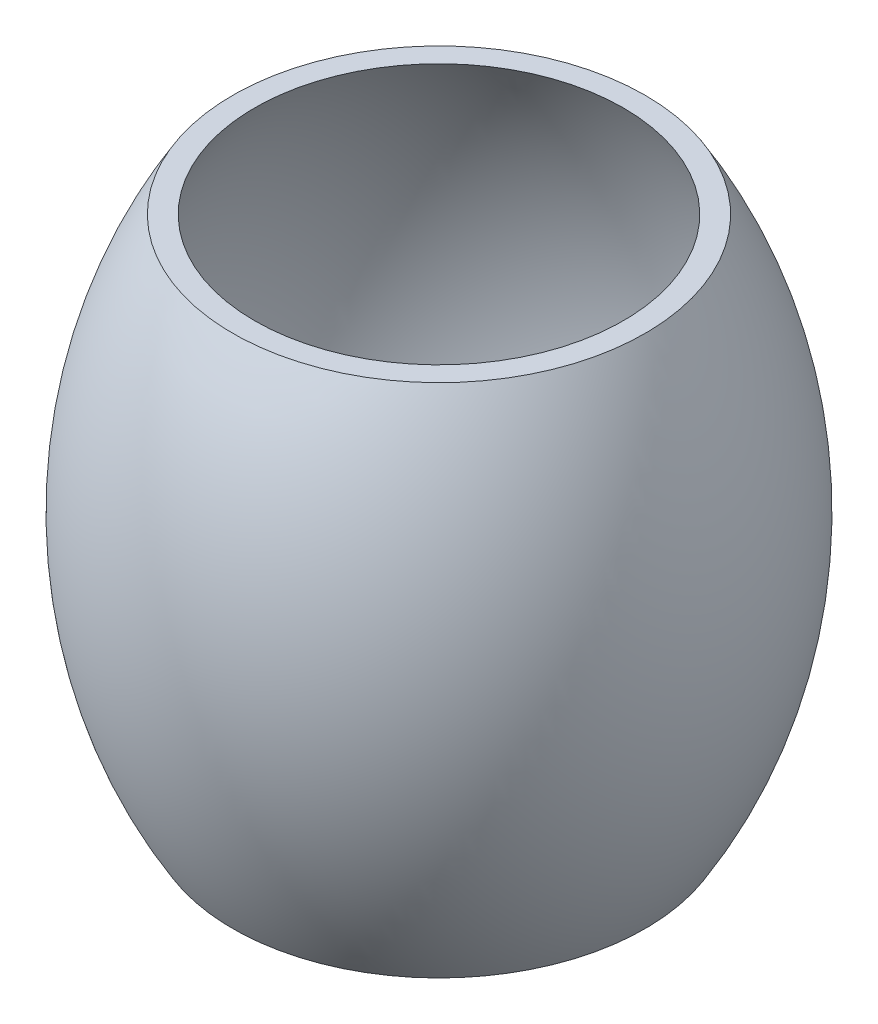
ISO-10303-21;
HEADER;
FILE_DESCRIPTION(('STEP AP214'),'2;1');
FILE_NAME('part.step','',(''),(''),'','','');
FILE_SCHEMA(('AUTOMOTIVE_DESIGN { 1 0 10303 214 1 1 1 1 }'));
ENDSEC;
DATA;
#1=APPLICATION_CONTEXT('core data for automotive mechanical design processes');
#2=APPLICATION_PROTOCOL_DEFINITION('international standard','automotive_design',2000,#1);
#3=PRODUCT_CONTEXT('',#1,'mechanical');
#4=PRODUCT('Part','Part','',(#3));
#5=PRODUCT_RELATED_PRODUCT_CATEGORY('part','',(#4));
#6=PRODUCT_DEFINITION_FORMATION('','',#4);
#7=PRODUCT_DEFINITION_CONTEXT('part definition',#1,'design');
#8=PRODUCT_DEFINITION('design','',#6,#7);
#9=PRODUCT_DEFINITION_SHAPE('','',#8);
#10=(LENGTH_UNIT() NAMED_UNIT(*) SI_UNIT(.MILLI.,.METRE.));
#11=(NAMED_UNIT(*) PLANE_ANGLE_UNIT() SI_UNIT($,.RADIAN.));
#12=(NAMED_UNIT(*) SI_UNIT($,.STERADIAN.) SOLID_ANGLE_UNIT());
#13=UNCERTAINTY_MEASURE_WITH_UNIT(LENGTH_MEASURE(1.E-05),#10,'distance_accuracy_value','');
#14=(GEOMETRIC_REPRESENTATION_CONTEXT(3) GLOBAL_UNCERTAINTY_ASSIGNED_CONTEXT((#13)) GLOBAL_UNIT_ASSIGNED_CONTEXT((#10,
#11,#12)) REPRESENTATION_CONTEXT('',''));
#15=CARTESIAN_POINT('',(0.,0.,0.));
#16=DIRECTION('',(0.,0.,1.));
#17=DIRECTION('',(1.,0.,0.));
#18=AXIS2_PLACEMENT_3D('',#15,#16,#17);
#19=CARTESIAN_POINT('',(0.,-51.7505235046713,0.));
#20=DIRECTION('',(0.,1.,0.));
#21=DIRECTION('',(0.,0.,1.));
#22=AXIS2_PLACEMENT_3D('',#19,#20,#21);
#23=PLANE('',#22);
#24=CARTESIAN_POINT('',(128.087550226234,-51.7505235046713,-73.9513816029573));
#25=DIRECTION('',(0.,1.,0.));
#26=DIRECTION('',(0.,0.,1.));
#27=AXIS2_PLACEMENT_3D('',#24,#25,#26);
#28=CIRCLE('',#27,22.4999999999971);
#29=CARTESIAN_POINT('',(128.087550226234,-51.7505235046713,-51.4513816029602));
#30=VERTEX_POINT('',#29);
#31=EDGE_CURVE('E60',#30,#30,#28,.F.);
#32=ORIENTED_EDGE('',*,*,#31,.F.);
#33=EDGE_LOOP('',(#32));
#34=FACE_BOUND('',#33,.T.);
#35=CARTESIAN_POINT('',(0.,-51.7505235046713,0.));
#36=DIRECTION('',(0.,-1.,0.));
#37=DIRECTION('',(0.,0.,-1.));
#38=AXIS2_PLACEMENT_3D('',#35,#36,#37);
#39=CIRCLE('',#38,200.);
#40=CARTESIAN_POINT('',(0.,-51.7505235046713,-200.));
#41=VERTEX_POINT('',#40);
#42=EDGE_CURVE('E66',#41,#41,#39,.T.);
#43=ORIENTED_EDGE('',*,*,#42,.T.);
#44=EDGE_LOOP('',(#43));
#45=FACE_BOUND('',#44,.T.);
#46=CARTESIAN_POINT('',(7.74964473582105E-12,-51.7505235046713,147.902763205909));
#47=DIRECTION('',(0.,1.,0.));
#48=DIRECTION('',(0.,0.,1.));
#49=AXIS2_PLACEMENT_3D('',#46,#47,#48);
#50=CIRCLE('',#49,22.4999999999915);
#51=CARTESIAN_POINT('',(7.74964473582105E-12,-51.7505235046713,170.4027632059));
#52=VERTEX_POINT('',#51);
#53=EDGE_CURVE('E63',#52,#52,#50,.F.);
#54=ORIENTED_EDGE('',*,*,#53,.F.);
#55=EDGE_LOOP('',(#54));
#56=FACE_BOUND('',#55,.T.);
#57=CARTESIAN_POINT('',(-128.087550226229,-51.7505235046713,-73.9513816029513));
#58=DIRECTION('',(0.,1.,0.));
#59=DIRECTION('',(0.,0.,1.));
#60=AXIS2_PLACEMENT_3D('',#57,#58,#59);
#61=CIRCLE('',#60,22.5);
#62=CARTESIAN_POINT('',(-128.087550226229,-51.7505235046713,-51.4513816029513));
#63=VERTEX_POINT('',#62);
#64=EDGE_CURVE('E57',#63,#63,#61,.F.);
#65=ORIENTED_EDGE('',*,*,#64,.F.);
#66=EDGE_LOOP('',(#65));
#67=FACE_BOUND('',#66,.T.);
#68=ADVANCED_FACE('F31',(#34,#45,#56,#67),#23,.F.);
#69=CARTESIAN_POINT('',(0.,448.249476495329,0.));
#70=DIRECTION('',(0.,1.,0.));
#71=DIRECTION('',(0.,0.,1.));
#72=AXIS2_PLACEMENT_3D('',#69,#70,#71);
#73=CONICAL_SURFACE('',#72,0.,1.57079538252152);
#74=CARTESIAN_POINT('',(0.,448.249645364481,0.));
#75=DIRECTION('',(0.,-1.,0.));
#76=DIRECTION('',(0.,0.,-1.));
#77=AXIS2_PLACEMENT_3D('',#74,#75,#76);
#78=CIRCLE('',#77,178.835025618102);
#79=CARTESIAN_POINT('',(0.,448.249645364481,-178.835025618102));
#80=VERTEX_POINT('',#79);
#81=EDGE_CURVE('E73',#80,#80,#78,.T.);
#82=ORIENTED_EDGE('',*,*,#81,.T.);
#83=EDGE_LOOP('',(#82));
#84=FACE_BOUND('',#83,.T.);
#85=CARTESIAN_POINT('',(0.,448.249665350003,0.));
#86=DIRECTION('',(0.,-1.,0.));
#87=DIRECTION('',(0.,0.,-1.));
#88=AXIS2_PLACEMENT_3D('',#85,#86,#87);
#89=CIRCLE('',#88,199.999999999911);
#90=CARTESIAN_POINT('',(0.,448.249665350003,-199.999999999911));
#91=VERTEX_POINT('',#90);
#92=EDGE_CURVE('E69',#91,#91,#89,.T.);
#93=ORIENTED_EDGE('',*,*,#92,.F.);
#94=EDGE_LOOP('',(#93));
#95=FACE_BOUND('',#94,.T.);
#96=ADVANCED_FACE('F92',(#84,#95),#73,.F.);
#97=CARTESIAN_POINT('',(0.,198.249570922592,0.));
#98=DIRECTION('',(0.,-1.,0.));
#99=DIRECTION('',(0.,0.,-1.));
#100=AXIS2_PLACEMENT_3D('',#97,#98,#99);
#101=DEGENERATE_TOROIDAL_SURFACE('',#100,214.865376896361,484.369,.F.);
#102=ORIENTED_EDGE('',*,*,#42,.F.);
#103=EDGE_LOOP('',(#102));
#104=FACE_BOUND('',#103,.T.);
#105=ORIENTED_EDGE('',*,*,#92,.T.);
#106=EDGE_LOOP('',(#105));
#107=FACE_BOUND('',#106,.T.);
#108=ADVANCED_FACE('F84',(#104,#107),#101,.F.);
#109=CARTESIAN_POINT('',(0.,-33.7505235046713,0.));
#110=DIRECTION('',(0.,1.,0.));
#111=DIRECTION('',(0.,0.,1.));
#112=AXIS2_PLACEMENT_3D('',#109,#110,#111);
#113=PLANE('',#112);
#114=CARTESIAN_POINT('',(0.,-33.7505235046713,0.));
#115=DIRECTION('',(0.,1.,0.));
#116=DIRECTION('',(0.,0.,1.));
#117=AXIS2_PLACEMENT_3D('',#114,#115,#116);
#118=CIRCLE('',#117,189.703529900418);
#119=CARTESIAN_POINT('',(0.,-33.7505235046713,189.703529900418));
#120=VERTEX_POINT('',#119);
#121=EDGE_CURVE('E72',#120,#120,#118,.F.);
#122=ORIENTED_EDGE('',*,*,#121,.F.);
#123=EDGE_LOOP('',(#122));
#124=FACE_BOUND('',#123,.T.);
#125=ADVANCED_FACE('F82',(#124),#113,.T.);
#126=CARTESIAN_POINT('',(0.,198.249570922592,0.));
#127=DIRECTION('',(0.,-1.,0.));
#128=DIRECTION('',(0.,0.,-1.));
#129=AXIS2_PLACEMENT_3D('',#126,#127,#128);
#130=DEGENERATE_TOROIDAL_SURFACE('',#129,214.865376896361,466.369,.F.);
#131=ORIENTED_EDGE('',*,*,#121,.T.);
#132=EDGE_LOOP('',(#131));
#133=FACE_BOUND('',#132,.T.);
#134=ORIENTED_EDGE('',*,*,#81,.F.);
#135=EDGE_LOOP('',(#134));
#136=FACE_BOUND('',#135,.T.);
#137=ADVANCED_FACE('F79',(#133,#136),#130,.T.);
#138=CARTESIAN_POINT('',(7.74964473582105E-12,-71.7505235046713,147.902763205909));
#139=DIRECTION('',(0.,1.,0.));
#140=DIRECTION('',(0.,0.,1.));
#141=AXIS2_PLACEMENT_3D('',#138,#139,#140);
#142=CYLINDRICAL_SURFACE('',#141,22.4999999999915);
#143=CARTESIAN_POINT('',(7.74964473582105E-12,-66.7505235046713,147.902763205909));
#144=DIRECTION('',(0.,-1.,0.));
#145=DIRECTION('',(0.,0.,-1.));
#146=AXIS2_PLACEMENT_3D('',#143,#144,#145);
#147=CIRCLE('',#146,22.4999999999915);
#148=CARTESIAN_POINT('',(7.74964473582105E-12,-66.7505235046713,125.402763205917));
#149=VERTEX_POINT('',#148);
#150=EDGE_CURVE('E10',#149,#149,#147,.F.);
#151=ORIENTED_EDGE('',*,*,#150,.T.);
#152=EDGE_LOOP('',(#151));
#153=FACE_BOUND('',#152,.T.);
#154=ORIENTED_EDGE('',*,*,#53,.T.);
#155=EDGE_LOOP('',(#154));
#156=FACE_BOUND('',#155,.T.);
#157=ADVANCED_FACE('F90',(#153,#156),#142,.T.);
#158=CARTESIAN_POINT('',(7.74964473582105E-12,-71.7505235046713,147.902763205909));
#159=DIRECTION('',(0.,-1.,0.));
#160=DIRECTION('',(0.,0.,-1.));
#161=AXIS2_PLACEMENT_3D('',#158,#159,#160);
#162=PLANE('',#161);
#163=CARTESIAN_POINT('',(7.74964473582105E-12,-71.7505235046713,147.902763205909));
#164=DIRECTION('',(0.,-1.,0.));
#165=DIRECTION('',(0.,0.,-1.));
#166=AXIS2_PLACEMENT_3D('',#163,#164,#165);
#167=CIRCLE('',#166,17.4999999999915);
#168=CARTESIAN_POINT('',(7.74964473582105E-12,-71.7505235046713,130.402763205917));
#169=VERTEX_POINT('',#168);
#170=EDGE_CURVE('E38',#169,#169,#167,.T.);
#171=ORIENTED_EDGE('',*,*,#170,.T.);
#172=EDGE_LOOP('',(#171));
#173=FACE_BOUND('',#172,.T.);
#174=ADVANCED_FACE('F138',(#173),#162,.T.);
#175=CARTESIAN_POINT('',(128.087550226234,-71.7505235046713,-73.9513816029573));
#176=DIRECTION('',(0.,1.,0.));
#177=DIRECTION('',(0.,0.,1.));
#178=AXIS2_PLACEMENT_3D('',#175,#176,#177);
#179=CYLINDRICAL_SURFACE('',#178,22.4999999999971);
#180=CARTESIAN_POINT('',(128.087550226234,-66.7505235046713,-73.9513816029573));
#181=DIRECTION('',(0.,-1.,0.));
#182=DIRECTION('',(0.,0.,-1.));
#183=AXIS2_PLACEMENT_3D('',#180,#181,#182);
#184=CIRCLE('',#183,22.4999999999971);
#185=CARTESIAN_POINT('',(128.087550226234,-66.7505235046713,-96.4513816029545));
#186=VERTEX_POINT('',#185);
#187=EDGE_CURVE('E51',#186,#186,#184,.F.);
#188=ORIENTED_EDGE('',*,*,#187,.T.);
#189=EDGE_LOOP('',(#188));
#190=FACE_BOUND('',#189,.T.);
#191=ORIENTED_EDGE('',*,*,#31,.T.);
#192=EDGE_LOOP('',(#191));
#193=FACE_BOUND('',#192,.T.);
#194=ADVANCED_FACE('F134',(#190,#193),#179,.T.);
#195=CARTESIAN_POINT('',(128.087550226234,-71.7505235046713,-73.9513816029573));
#196=DIRECTION('',(0.,-1.,0.));
#197=DIRECTION('',(0.,0.,-1.));
#198=AXIS2_PLACEMENT_3D('',#195,#196,#197);
#199=PLANE('',#198);
#200=CARTESIAN_POINT('',(128.087550226234,-71.7505235046713,-73.9513816029573));
#201=DIRECTION('',(0.,-1.,0.));
#202=DIRECTION('',(0.,0.,-1.));
#203=AXIS2_PLACEMENT_3D('',#200,#201,#202);
#204=CIRCLE('',#203,17.4999999999971);
#205=CARTESIAN_POINT('',(128.087550226234,-71.7505235046713,-91.4513816029545));
#206=VERTEX_POINT('',#205);
#207=EDGE_CURVE('E54',#206,#206,#204,.T.);
#208=ORIENTED_EDGE('',*,*,#207,.T.);
#209=EDGE_LOOP('',(#208));
#210=FACE_BOUND('',#209,.T.);
#211=ADVANCED_FACE('F128',(#210),#199,.T.);
#212=CARTESIAN_POINT('',(-128.087550226229,-71.7505235046713,-73.9513816029513));
#213=DIRECTION('',(0.,1.,0.));
#214=DIRECTION('',(0.,0.,1.));
#215=AXIS2_PLACEMENT_3D('',#212,#213,#214);
#216=CYLINDRICAL_SURFACE('',#215,22.5);
#217=CARTESIAN_POINT('',(-128.087550226229,-66.7505235046713,-73.9513816029513));
#218=DIRECTION('',(0.,-1.,0.));
#219=DIRECTION('',(0.,0.,-1.));
#220=AXIS2_PLACEMENT_3D('',#217,#218,#219);
#221=CIRCLE('',#220,22.5);
#222=CARTESIAN_POINT('',(-128.087550226229,-66.7505235046713,-96.4513816029512));
#223=VERTEX_POINT('',#222);
#224=EDGE_CURVE('E42',#223,#223,#221,.F.);
#225=ORIENTED_EDGE('',*,*,#224,.T.);
#226=EDGE_LOOP('',(#225));
#227=FACE_BOUND('',#226,.T.);
#228=ORIENTED_EDGE('',*,*,#64,.T.);
#229=EDGE_LOOP('',(#228));
#230=FACE_BOUND('',#229,.T.);
#231=ADVANCED_FACE('F123',(#227,#230),#216,.T.);
#232=CARTESIAN_POINT('',(-128.087550226229,-71.7505235046713,-73.9513816029513));
#233=DIRECTION('',(0.,-1.,0.));
#234=DIRECTION('',(0.,0.,-1.));
#235=AXIS2_PLACEMENT_3D('',#232,#233,#234);
#236=PLANE('',#235);
#237=CARTESIAN_POINT('',(-128.087550226229,-71.7505235046713,-73.9513816029513));
#238=DIRECTION('',(0.,-1.,0.));
#239=DIRECTION('',(0.,0.,-1.));
#240=AXIS2_PLACEMENT_3D('',#237,#238,#239);
#241=CIRCLE('',#240,17.5);
#242=CARTESIAN_POINT('',(-128.087550226229,-71.7505235046713,-91.4513816029512));
#243=VERTEX_POINT('',#242);
#244=EDGE_CURVE('E46',#243,#243,#241,.T.);
#245=ORIENTED_EDGE('',*,*,#244,.T.);
#246=EDGE_LOOP('',(#245));
#247=FACE_BOUND('',#246,.T.);
#248=ADVANCED_FACE('F110',(#247),#236,.T.);
#249=CARTESIAN_POINT('',(128.087550226234,-66.7505235046713,-73.9513816029573));
#250=DIRECTION('',(0.,-1.,0.));
#251=DIRECTION('',(0.,0.,-1.));
#252=AXIS2_PLACEMENT_3D('',#249,#250,#251);
#253=TOROIDAL_SURFACE('',#252,17.4999999999971,5.);
#254=ORIENTED_EDGE('',*,*,#187,.F.);
#255=EDGE_LOOP('',(#254));
#256=FACE_BOUND('',#255,.T.);
#257=ORIENTED_EDGE('',*,*,#207,.F.);
#258=EDGE_LOOP('',(#257));
#259=FACE_BOUND('',#258,.T.);
#260=ADVANCED_FACE('F107',(#256,#259),#253,.T.);
#261=CARTESIAN_POINT('',(-128.087550226229,-66.7505235046713,-73.9513816029513));
#262=DIRECTION('',(0.,-1.,0.));
#263=DIRECTION('',(0.,0.,-1.));
#264=AXIS2_PLACEMENT_3D('',#261,#262,#263);
#265=TOROIDAL_SURFACE('',#264,17.5,5.);
#266=ORIENTED_EDGE('',*,*,#224,.F.);
#267=EDGE_LOOP('',(#266));
#268=FACE_BOUND('',#267,.T.);
#269=ORIENTED_EDGE('',*,*,#244,.F.);
#270=EDGE_LOOP('',(#269));
#271=FACE_BOUND('',#270,.T.);
#272=ADVANCED_FACE('F109',(#268,#271),#265,.T.);
#273=CARTESIAN_POINT('',(7.74964473582105E-12,-66.7505235046713,147.902763205909));
#274=DIRECTION('',(0.,-1.,0.));
#275=DIRECTION('',(0.,0.,-1.));
#276=AXIS2_PLACEMENT_3D('',#273,#274,#275);
#277=TOROIDAL_SURFACE('',#276,17.4999999999915,5.);
#278=ORIENTED_EDGE('',*,*,#150,.F.);
#279=EDGE_LOOP('',(#278));
#280=FACE_BOUND('',#279,.T.);
#281=ORIENTED_EDGE('',*,*,#170,.F.);
#282=EDGE_LOOP('',(#281));
#283=FACE_BOUND('',#282,.T.);
#284=ADVANCED_FACE('F33',(#280,#283),#277,.T.);
#285=CLOSED_SHELL('',(#68,#96,#108,#125,#137,#157,#174,#194,#211,#231,#248,#260,#272,#284));
#286=MANIFOLD_SOLID_BREP('B2',#285);
#287=ADVANCED_BREP_SHAPE_REPRESENTATION('',(#18,#286),#14);
#288=SHAPE_DEFINITION_REPRESENTATION(#9,#287);
ENDSEC;
END-ISO-10303-21;
